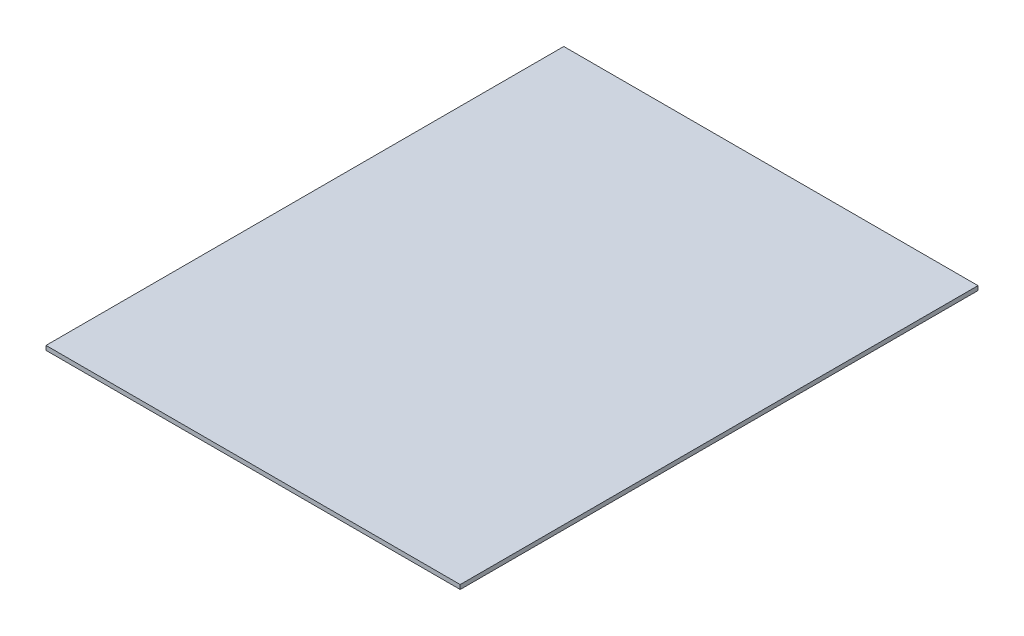
ISO-10303-21;
HEADER;
FILE_DESCRIPTION(('STEP AP214'),'2;1');
FILE_NAME('part.step','',(''),(''),'','','');
FILE_SCHEMA(('AUTOMOTIVE_DESIGN { 1 0 10303 214 1 1 1 1 }'));
ENDSEC;
DATA;
#1=APPLICATION_CONTEXT('core data for automotive mechanical design processes');
#2=APPLICATION_PROTOCOL_DEFINITION('international standard','automotive_design',2000,#1);
#3=PRODUCT_CONTEXT('',#1,'mechanical');
#4=PRODUCT('Part','Part','',(#3));
#5=PRODUCT_RELATED_PRODUCT_CATEGORY('part','',(#4));
#6=PRODUCT_DEFINITION_FORMATION('','',#4);
#7=PRODUCT_DEFINITION_CONTEXT('part definition',#1,'design');
#8=PRODUCT_DEFINITION('design','',#6,#7);
#9=PRODUCT_DEFINITION_SHAPE('','',#8);
#10=(LENGTH_UNIT() NAMED_UNIT(*) SI_UNIT(.MILLI.,.METRE.));
#11=(NAMED_UNIT(*) PLANE_ANGLE_UNIT() SI_UNIT($,.RADIAN.));
#12=(NAMED_UNIT(*) SI_UNIT($,.STERADIAN.) SOLID_ANGLE_UNIT());
#13=UNCERTAINTY_MEASURE_WITH_UNIT(LENGTH_MEASURE(1.E-05),#10,'distance_accuracy_value','');
#14=(GEOMETRIC_REPRESENTATION_CONTEXT(3) GLOBAL_UNCERTAINTY_ASSIGNED_CONTEXT((#13)) GLOBAL_UNIT_ASSIGNED_CONTEXT((#10,
#11,#12)) REPRESENTATION_CONTEXT('',''));
#15=CARTESIAN_POINT('',(0.,0.,0.));
#16=DIRECTION('',(0.,0.,1.));
#17=DIRECTION('',(1.,0.,0.));
#18=AXIS2_PLACEMENT_3D('',#15,#16,#17);
#19=CARTESIAN_POINT('',(0.,6.35,0.));
#20=DIRECTION('',(1.,0.,0.));
#21=DIRECTION('',(0.,0.,-1.));
#22=AXIS2_PLACEMENT_3D('',#19,#20,#21);
#23=PLANE('',#22);
#24=DIRECTION('',(0.,0.,1.));
#25=VECTOR('',#24,1.);
#26=CARTESIAN_POINT('',(0.,0.,0.));
#27=LINE('',#26,#25);
#28=CARTESIAN_POINT('',(0.,0.,-762.));
#29=VERTEX_POINT('',#28);
#30=CARTESIAN_POINT('',(0.,0.,0.));
#31=VERTEX_POINT('',#30);
#32=EDGE_CURVE('E96',#29,#31,#27,.T.);
#33=ORIENTED_EDGE('',*,*,#32,.T.);
#34=DIRECTION('',(0.,-1.,0.));
#35=VECTOR('',#34,1.);
#36=CARTESIAN_POINT('',(0.,6.35,0.));
#37=LINE('',#36,#35);
#38=CARTESIAN_POINT('',(0.,6.35,0.));
#39=VERTEX_POINT('',#38);
#40=EDGE_CURVE('E11',#39,#31,#37,.T.);
#41=ORIENTED_EDGE('',*,*,#40,.F.);
#42=DIRECTION('',(0.,0.,1.));
#43=VECTOR('',#42,1.);
#44=CARTESIAN_POINT('',(0.,6.35,0.));
#45=LINE('',#44,#43);
#46=CARTESIAN_POINT('',(0.,6.35,-762.));
#47=VERTEX_POINT('',#46);
#48=EDGE_CURVE('E84',#47,#39,#45,.T.);
#49=ORIENTED_EDGE('',*,*,#48,.F.);
#50=DIRECTION('',(0.,-1.,0.));
#51=VECTOR('',#50,1.);
#52=CARTESIAN_POINT('',(0.,6.35,-762.));
#53=LINE('',#52,#51);
#54=EDGE_CURVE('E92',#47,#29,#53,.T.);
#55=ORIENTED_EDGE('',*,*,#54,.T.);
#56=EDGE_LOOP('',(#33,#41,#49,#55));
#57=FACE_BOUND('',#56,.T.);
#58=ADVANCED_FACE('F33',(#57),#23,.F.);
#59=CARTESIAN_POINT('',(0.,6.35,0.));
#60=DIRECTION('',(0.,0.,-1.));
#61=DIRECTION('',(-1.,0.,0.));
#62=AXIS2_PLACEMENT_3D('',#59,#60,#61);
#63=PLANE('',#62);
#64=DIRECTION('',(1.,0.,0.));
#65=VECTOR('',#64,1.);
#66=CARTESIAN_POINT('',(0.,0.,0.));
#67=LINE('',#66,#65);
#68=CARTESIAN_POINT('',(609.6,0.,0.));
#69=VERTEX_POINT('',#68);
#70=EDGE_CURVE('E88',#31,#69,#67,.T.);
#71=ORIENTED_EDGE('',*,*,#70,.T.);
#72=DIRECTION('',(0.,-1.,0.));
#73=VECTOR('',#72,1.);
#74=CARTESIAN_POINT('',(609.6,6.35,0.));
#75=LINE('',#74,#73);
#76=CARTESIAN_POINT('',(609.6,6.35,0.));
#77=VERTEX_POINT('',#76);
#78=EDGE_CURVE('E41',#77,#69,#75,.T.);
#79=ORIENTED_EDGE('',*,*,#78,.F.);
#80=DIRECTION('',(1.,0.,0.));
#81=VECTOR('',#80,1.);
#82=CARTESIAN_POINT('',(0.,6.35,0.));
#83=LINE('',#82,#81);
#84=EDGE_CURVE('E79',#39,#77,#83,.T.);
#85=ORIENTED_EDGE('',*,*,#84,.F.);
#86=ORIENTED_EDGE('',*,*,#40,.T.);
#87=EDGE_LOOP('',(#71,#79,#85,#86));
#88=FACE_BOUND('',#87,.T.);
#89=ADVANCED_FACE('F87',(#88),#63,.F.);
#90=CARTESIAN_POINT('',(609.6,6.35,0.));
#91=DIRECTION('',(-1.,0.,0.));
#92=DIRECTION('',(0.,0.,1.));
#93=AXIS2_PLACEMENT_3D('',#90,#91,#92);
#94=PLANE('',#93);
#95=DIRECTION('',(0.,0.,-1.));
#96=VECTOR('',#95,1.);
#97=CARTESIAN_POINT('',(609.6,0.,0.));
#98=LINE('',#97,#96);
#99=CARTESIAN_POINT('',(609.6,0.,-762.));
#100=VERTEX_POINT('',#99);
#101=EDGE_CURVE('E66',#69,#100,#98,.T.);
#102=ORIENTED_EDGE('',*,*,#101,.T.);
#103=DIRECTION('',(0.,-1.,0.));
#104=VECTOR('',#103,1.);
#105=CARTESIAN_POINT('',(609.6,6.35,-762.));
#106=LINE('',#105,#104);
#107=CARTESIAN_POINT('',(609.6,6.35,-762.));
#108=VERTEX_POINT('',#107);
#109=EDGE_CURVE('E89',#108,#100,#106,.T.);
#110=ORIENTED_EDGE('',*,*,#109,.F.);
#111=DIRECTION('',(0.,0.,-1.));
#112=VECTOR('',#111,1.);
#113=CARTESIAN_POINT('',(609.6,6.35,0.));
#114=LINE('',#113,#112);
#115=EDGE_CURVE('E82',#77,#108,#114,.T.);
#116=ORIENTED_EDGE('',*,*,#115,.F.);
#117=ORIENTED_EDGE('',*,*,#78,.T.);
#118=EDGE_LOOP('',(#102,#110,#116,#117));
#119=FACE_BOUND('',#118,.T.);
#120=ADVANCED_FACE('F90',(#119),#94,.F.);
#121=CARTESIAN_POINT('',(0.,6.35,-762.));
#122=DIRECTION('',(0.,0.,1.));
#123=DIRECTION('',(1.,0.,0.));
#124=AXIS2_PLACEMENT_3D('',#121,#122,#123);
#125=PLANE('',#124);
#126=DIRECTION('',(-1.,0.,0.));
#127=VECTOR('',#126,1.);
#128=CARTESIAN_POINT('',(0.,0.,-762.));
#129=LINE('',#128,#127);
#130=EDGE_CURVE('E72',#100,#29,#129,.T.);
#131=ORIENTED_EDGE('',*,*,#130,.T.);
#132=ORIENTED_EDGE('',*,*,#54,.F.);
#133=DIRECTION('',(-1.,0.,0.));
#134=VECTOR('',#133,1.);
#135=CARTESIAN_POINT('',(0.,6.35,-762.));
#136=LINE('',#135,#134);
#137=EDGE_CURVE('E49',#108,#47,#136,.T.);
#138=ORIENTED_EDGE('',*,*,#137,.F.);
#139=ORIENTED_EDGE('',*,*,#109,.T.);
#140=EDGE_LOOP('',(#131,#132,#138,#139));
#141=FACE_BOUND('',#140,.T.);
#142=ADVANCED_FACE('F103',(#141),#125,.F.);
#143=CARTESIAN_POINT('',(0.,6.35,0.));
#144=DIRECTION('',(0.,-1.,0.));
#145=DIRECTION('',(0.,0.,-1.));
#146=AXIS2_PLACEMENT_3D('',#143,#144,#145);
#147=PLANE('',#146);
#148=ORIENTED_EDGE('',*,*,#48,.T.);
#149=ORIENTED_EDGE('',*,*,#84,.T.);
#150=ORIENTED_EDGE('',*,*,#115,.T.);
#151=ORIENTED_EDGE('',*,*,#137,.T.);
#152=EDGE_LOOP('',(#148,#149,#150,#151));
#153=FACE_BOUND('',#152,.T.);
#154=ADVANCED_FACE('F80',(#153),#147,.F.);
#155=CARTESIAN_POINT('',(0.,0.,0.));
#156=DIRECTION('',(0.,-1.,0.));
#157=DIRECTION('',(0.,0.,-1.));
#158=AXIS2_PLACEMENT_3D('',#155,#156,#157);
#159=PLANE('',#158);
#160=ORIENTED_EDGE('',*,*,#32,.F.);
#161=ORIENTED_EDGE('',*,*,#130,.F.);
#162=ORIENTED_EDGE('',*,*,#101,.F.);
#163=ORIENTED_EDGE('',*,*,#70,.F.);
#164=EDGE_LOOP('',(#160,#161,#162,#163));
#165=FACE_BOUND('',#164,.T.);
#166=ADVANCED_FACE('F106',(#165),#159,.T.);
#167=CLOSED_SHELL('',(#58,#89,#120,#142,#154,#166));
#168=MANIFOLD_SOLID_BREP('B2',#167);
#169=ADVANCED_BREP_SHAPE_REPRESENTATION('',(#18,#168),#14);
#170=SHAPE_DEFINITION_REPRESENTATION(#9,#169);
ENDSEC;
END-ISO-10303-21;
